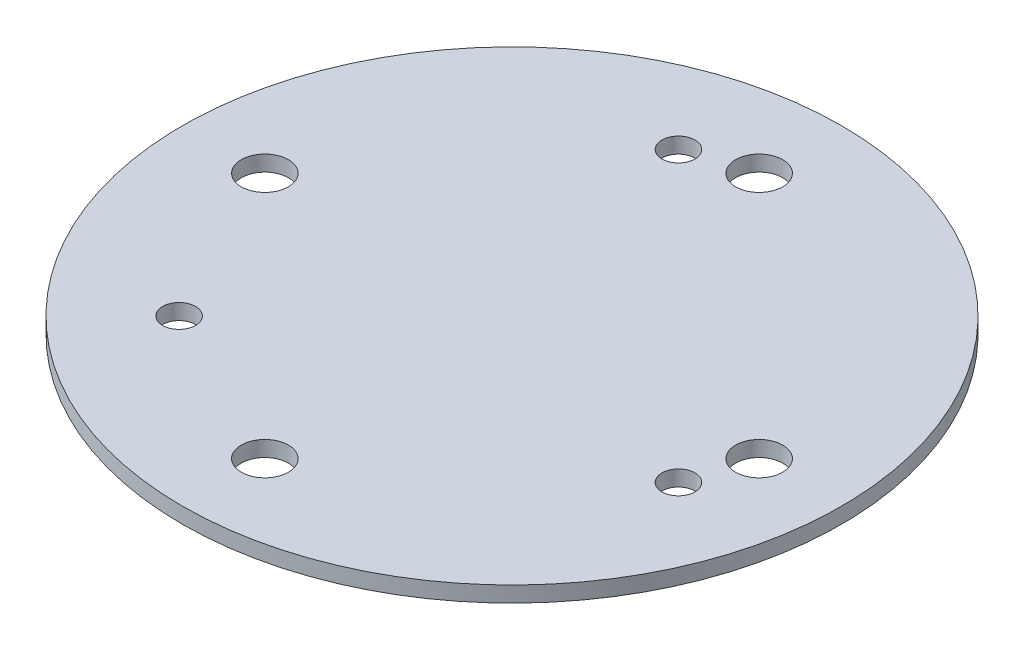
ISO-10303-21;
HEADER;
FILE_DESCRIPTION(('STEP AP214'),'2;1');
FILE_NAME('part.step','',(''),(''),'','','');
FILE_SCHEMA(('AUTOMOTIVE_DESIGN { 1 0 10303 214 1 1 1 1 }'));
ENDSEC;
DATA;
#1=APPLICATION_CONTEXT('core data for automotive mechanical design processes');
#2=APPLICATION_PROTOCOL_DEFINITION('international standard','automotive_design',2000,#1);
#3=PRODUCT_CONTEXT('',#1,'mechanical');
#4=PRODUCT('Part','Part','',(#3));
#5=PRODUCT_RELATED_PRODUCT_CATEGORY('part','',(#4));
#6=PRODUCT_DEFINITION_FORMATION('','',#4);
#7=PRODUCT_DEFINITION_CONTEXT('part definition',#1,'design');
#8=PRODUCT_DEFINITION('design','',#6,#7);
#9=PRODUCT_DEFINITION_SHAPE('','',#8);
#10=(LENGTH_UNIT() NAMED_UNIT(*) SI_UNIT(.MILLI.,.METRE.));
#11=(NAMED_UNIT(*) PLANE_ANGLE_UNIT() SI_UNIT($,.RADIAN.));
#12=(NAMED_UNIT(*) SI_UNIT($,.STERADIAN.) SOLID_ANGLE_UNIT());
#13=UNCERTAINTY_MEASURE_WITH_UNIT(LENGTH_MEASURE(1.E-05),#10,'distance_accuracy_value','');
#14=(GEOMETRIC_REPRESENTATION_CONTEXT(3) GLOBAL_UNCERTAINTY_ASSIGNED_CONTEXT((#13)) GLOBAL_UNIT_ASSIGNED_CONTEXT((#10,
#11,#12)) REPRESENTATION_CONTEXT('',''));
#15=CARTESIAN_POINT('',(0.,0.,0.));
#16=DIRECTION('',(0.,0.,1.));
#17=DIRECTION('',(1.,0.,0.));
#18=AXIS2_PLACEMENT_3D('',#15,#16,#17);
#19=CARTESIAN_POINT('',(0.,0.,0.));
#20=DIRECTION('',(0.,1.,0.));
#21=DIRECTION('',(0.,0.,1.));
#22=AXIS2_PLACEMENT_3D('',#19,#20,#21);
#23=PLANE('',#22);
#24=CARTESIAN_POINT('',(0.,0.,-31.5));
#25=DIRECTION('',(0.,1.,0.));
#26=DIRECTION('',(0.,0.,1.));
#27=AXIS2_PLACEMENT_3D('',#24,#25,#26);
#28=CIRCLE('',#27,3.);
#29=CARTESIAN_POINT('',(0.,0.,-28.5));
#30=VERTEX_POINT('',#29);
#31=EDGE_CURVE('E54',#30,#30,#28,.T.);
#32=ORIENTED_EDGE('',*,*,#31,.T.);
#33=EDGE_LOOP('',(#32));
#34=FACE_BOUND('',#33,.T.);
#35=CARTESIAN_POINT('',(0.,0.,31.5));
#36=DIRECTION('',(0.,1.,0.));
#37=DIRECTION('',(0.,0.,1.));
#38=AXIS2_PLACEMENT_3D('',#35,#36,#37);
#39=CIRCLE('',#38,3.);
#40=CARTESIAN_POINT('',(0.,0.,34.5));
#41=VERTEX_POINT('',#40);
#42=EDGE_CURVE('E45',#41,#41,#39,.T.);
#43=ORIENTED_EDGE('',*,*,#42,.T.);
#44=EDGE_LOOP('',(#43));
#45=FACE_BOUND('',#44,.T.);
#46=CARTESIAN_POINT('',(-21.2132034355964,0.,21.2132034355964));
#47=DIRECTION('',(0.,1.,0.));
#48=DIRECTION('',(0.,0.,1.));
#49=AXIS2_PLACEMENT_3D('',#46,#47,#48);
#50=CIRCLE('',#49,2.1);
#51=CARTESIAN_POINT('',(-21.2132034355964,0.,23.3132034355964));
#52=VERTEX_POINT('',#51);
#53=EDGE_CURVE('E48',#52,#52,#50,.T.);
#54=ORIENTED_EDGE('',*,*,#53,.T.);
#55=EDGE_LOOP('',(#54));
#56=FACE_BOUND('',#55,.T.);
#57=CARTESIAN_POINT('',(-31.5,0.,0.));
#58=DIRECTION('',(0.,1.,0.));
#59=DIRECTION('',(0.,0.,1.));
#60=AXIS2_PLACEMENT_3D('',#57,#58,#59);
#61=CIRCLE('',#60,3.);
#62=CARTESIAN_POINT('',(-31.5,0.,3.));
#63=VERTEX_POINT('',#62);
#64=EDGE_CURVE('E51',#63,#63,#61,.T.);
#65=ORIENTED_EDGE('',*,*,#64,.T.);
#66=EDGE_LOOP('',(#65));
#67=FACE_BOUND('',#66,.T.);
#68=CARTESIAN_POINT('',(31.5,0.,0.));
#69=DIRECTION('',(0.,1.,0.));
#70=DIRECTION('',(0.,0.,1.));
#71=AXIS2_PLACEMENT_3D('',#68,#69,#70);
#72=CIRCLE('',#71,3.);
#73=CARTESIAN_POINT('',(31.5,0.,3.));
#74=VERTEX_POINT('',#73);
#75=EDGE_CURVE('E57',#74,#74,#72,.T.);
#76=ORIENTED_EDGE('',*,*,#75,.T.);
#77=EDGE_LOOP('',(#76));
#78=FACE_BOUND('',#77,.T.);
#79=CARTESIAN_POINT('',(-7.7645713530756,0.,-28.977774788672));
#80=DIRECTION('',(0.,1.,0.));
#81=DIRECTION('',(0.,0.,1.));
#82=AXIS2_PLACEMENT_3D('',#79,#80,#81);
#83=CIRCLE('',#82,2.1);
#84=CARTESIAN_POINT('',(-7.7645713530756,0.,-26.877774788672));
#85=VERTEX_POINT('',#84);
#86=EDGE_CURVE('E62',#85,#85,#83,.T.);
#87=ORIENTED_EDGE('',*,*,#86,.T.);
#88=EDGE_LOOP('',(#87));
#89=FACE_BOUND('',#88,.T.);
#90=CARTESIAN_POINT('',(28.977774788672,0.,7.76457135307563));
#91=DIRECTION('',(0.,1.,0.));
#92=DIRECTION('',(0.,0.,1.));
#93=AXIS2_PLACEMENT_3D('',#90,#91,#92);
#94=CIRCLE('',#93,2.1);
#95=CARTESIAN_POINT('',(28.977774788672,0.,9.86457135307563));
#96=VERTEX_POINT('',#95);
#97=EDGE_CURVE('E60',#96,#96,#94,.T.);
#98=ORIENTED_EDGE('',*,*,#97,.T.);
#99=EDGE_LOOP('',(#98));
#100=FACE_BOUND('',#99,.T.);
#101=CARTESIAN_POINT('',(0.,0.,0.));
#102=DIRECTION('',(0.,1.,0.));
#103=DIRECTION('',(0.,0.,1.));
#104=AXIS2_PLACEMENT_3D('',#101,#102,#103);
#105=CIRCLE('',#104,42.);
#106=CARTESIAN_POINT('',(0.,0.,42.));
#107=VERTEX_POINT('',#106);
#108=EDGE_CURVE('E16',#107,#107,#105,.T.);
#109=ORIENTED_EDGE('',*,*,#108,.F.);
#110=EDGE_LOOP('',(#109));
#111=FACE_BOUND('',#110,.T.);
#112=ADVANCED_FACE('F13',(#34,#45,#56,#67,#78,#89,#100,#111),#23,.F.);
#113=CARTESIAN_POINT('',(0.,0.,0.));
#114=DIRECTION('',(0.,1.,0.));
#115=DIRECTION('',(0.,0.,1.));
#116=AXIS2_PLACEMENT_3D('',#113,#114,#115);
#117=CYLINDRICAL_SURFACE('',#116,42.);
#118=ORIENTED_EDGE('',*,*,#108,.T.);
#119=EDGE_LOOP('',(#118));
#120=FACE_BOUND('',#119,.T.);
#121=CARTESIAN_POINT('',(0.,2.,0.));
#122=DIRECTION('',(0.,1.,0.));
#123=DIRECTION('',(0.,0.,1.));
#124=AXIS2_PLACEMENT_3D('',#121,#122,#123);
#125=CIRCLE('',#124,42.);
#126=CARTESIAN_POINT('',(0.,2.,42.));
#127=VERTEX_POINT('',#126);
#128=EDGE_CURVE('E42',#127,#127,#125,.T.);
#129=ORIENTED_EDGE('',*,*,#128,.F.);
#130=EDGE_LOOP('',(#129));
#131=FACE_BOUND('',#130,.T.);
#132=ADVANCED_FACE('F69',(#120,#131),#117,.T.);
#133=CARTESIAN_POINT('',(-7.7645713530756,0.,-28.977774788672));
#134=DIRECTION('',(0.,1.,0.));
#135=DIRECTION('',(0.,0.,1.));
#136=AXIS2_PLACEMENT_3D('',#133,#134,#135);
#137=CYLINDRICAL_SURFACE('',#136,2.1);
#138=CARTESIAN_POINT('',(-7.7645713530756,2.,-28.977774788672));
#139=DIRECTION('',(0.,1.,0.));
#140=DIRECTION('',(0.,0.,1.));
#141=AXIS2_PLACEMENT_3D('',#138,#139,#140);
#142=CIRCLE('',#141,2.1);
#143=CARTESIAN_POINT('',(-7.7645713530756,2.,-26.877774788672));
#144=VERTEX_POINT('',#143);
#145=EDGE_CURVE('E39',#144,#144,#142,.F.);
#146=ORIENTED_EDGE('',*,*,#145,.F.);
#147=EDGE_LOOP('',(#146));
#148=FACE_BOUND('',#147,.T.);
#149=ORIENTED_EDGE('',*,*,#86,.F.);
#150=EDGE_LOOP('',(#149));
#151=FACE_BOUND('',#150,.T.);
#152=ADVANCED_FACE('F78',(#148,#151),#137,.F.);
#153=CARTESIAN_POINT('',(28.977774788672,0.,7.76457135307563));
#154=DIRECTION('',(0.,1.,0.));
#155=DIRECTION('',(0.,0.,1.));
#156=AXIS2_PLACEMENT_3D('',#153,#154,#155);
#157=CYLINDRICAL_SURFACE('',#156,2.1);
#158=CARTESIAN_POINT('',(28.977774788672,2.,7.76457135307563));
#159=DIRECTION('',(0.,1.,0.));
#160=DIRECTION('',(0.,0.,1.));
#161=AXIS2_PLACEMENT_3D('',#158,#159,#160);
#162=CIRCLE('',#161,2.1);
#163=CARTESIAN_POINT('',(28.977774788672,2.,9.86457135307563));
#164=VERTEX_POINT('',#163);
#165=EDGE_CURVE('E36',#164,#164,#162,.F.);
#166=ORIENTED_EDGE('',*,*,#165,.F.);
#167=EDGE_LOOP('',(#166));
#168=FACE_BOUND('',#167,.T.);
#169=ORIENTED_EDGE('',*,*,#97,.F.);
#170=EDGE_LOOP('',(#169));
#171=FACE_BOUND('',#170,.T.);
#172=ADVANCED_FACE('F106',(#168,#171),#157,.F.);
#173=CARTESIAN_POINT('',(31.5,0.,0.));
#174=DIRECTION('',(0.,1.,0.));
#175=DIRECTION('',(0.,0.,1.));
#176=AXIS2_PLACEMENT_3D('',#173,#174,#175);
#177=CYLINDRICAL_SURFACE('',#176,3.);
#178=CARTESIAN_POINT('',(31.5,2.,0.));
#179=DIRECTION('',(0.,1.,0.));
#180=DIRECTION('',(0.,0.,1.));
#181=AXIS2_PLACEMENT_3D('',#178,#179,#180);
#182=CIRCLE('',#181,3.);
#183=CARTESIAN_POINT('',(31.5,2.,3.));
#184=VERTEX_POINT('',#183);
#185=EDGE_CURVE('E33',#184,#184,#182,.F.);
#186=ORIENTED_EDGE('',*,*,#185,.F.);
#187=EDGE_LOOP('',(#186));
#188=FACE_BOUND('',#187,.T.);
#189=ORIENTED_EDGE('',*,*,#75,.F.);
#190=EDGE_LOOP('',(#189));
#191=FACE_BOUND('',#190,.T.);
#192=ADVANCED_FACE('F102',(#188,#191),#177,.F.);
#193=CARTESIAN_POINT('',(0.,0.,-31.5));
#194=DIRECTION('',(0.,1.,0.));
#195=DIRECTION('',(0.,0.,1.));
#196=AXIS2_PLACEMENT_3D('',#193,#194,#195);
#197=CYLINDRICAL_SURFACE('',#196,3.);
#198=ORIENTED_EDGE('',*,*,#31,.F.);
#199=EDGE_LOOP('',(#198));
#200=FACE_BOUND('',#199,.T.);
#201=CARTESIAN_POINT('',(0.,2.,-31.5));
#202=DIRECTION('',(0.,1.,0.));
#203=DIRECTION('',(0.,0.,1.));
#204=AXIS2_PLACEMENT_3D('',#201,#202,#203);
#205=CIRCLE('',#204,3.);
#206=CARTESIAN_POINT('',(0.,2.,-28.5));
#207=VERTEX_POINT('',#206);
#208=EDGE_CURVE('E30',#207,#207,#205,.F.);
#209=ORIENTED_EDGE('',*,*,#208,.F.);
#210=EDGE_LOOP('',(#209));
#211=FACE_BOUND('',#210,.T.);
#212=ADVANCED_FACE('F98',(#200,#211),#197,.F.);
#213=CARTESIAN_POINT('',(-31.5,0.,0.));
#214=DIRECTION('',(0.,1.,0.));
#215=DIRECTION('',(0.,0.,1.));
#216=AXIS2_PLACEMENT_3D('',#213,#214,#215);
#217=CYLINDRICAL_SURFACE('',#216,3.);
#218=ORIENTED_EDGE('',*,*,#64,.F.);
#219=EDGE_LOOP('',(#218));
#220=FACE_BOUND('',#219,.T.);
#221=CARTESIAN_POINT('',(-31.5,2.,0.));
#222=DIRECTION('',(0.,1.,0.));
#223=DIRECTION('',(0.,0.,1.));
#224=AXIS2_PLACEMENT_3D('',#221,#222,#223);
#225=CIRCLE('',#224,3.);
#226=CARTESIAN_POINT('',(-31.5,2.,3.));
#227=VERTEX_POINT('',#226);
#228=EDGE_CURVE('E25',#227,#227,#225,.F.);
#229=ORIENTED_EDGE('',*,*,#228,.F.);
#230=EDGE_LOOP('',(#229));
#231=FACE_BOUND('',#230,.T.);
#232=ADVANCED_FACE('F94',(#220,#231),#217,.F.);
#233=CARTESIAN_POINT('',(-21.2132034355964,0.,21.2132034355964));
#234=DIRECTION('',(0.,1.,0.));
#235=DIRECTION('',(0.,0.,1.));
#236=AXIS2_PLACEMENT_3D('',#233,#234,#235);
#237=CYLINDRICAL_SURFACE('',#236,2.1);
#238=ORIENTED_EDGE('',*,*,#53,.F.);
#239=EDGE_LOOP('',(#238));
#240=FACE_BOUND('',#239,.T.);
#241=CARTESIAN_POINT('',(-21.2132034355964,2.,21.2132034355964));
#242=DIRECTION('',(0.,1.,0.));
#243=DIRECTION('',(0.,0.,1.));
#244=AXIS2_PLACEMENT_3D('',#241,#242,#243);
#245=CIRCLE('',#244,2.1);
#246=CARTESIAN_POINT('',(-21.2132034355964,2.,23.3132034355964));
#247=VERTEX_POINT('',#246);
#248=EDGE_CURVE('E20',#247,#247,#245,.F.);
#249=ORIENTED_EDGE('',*,*,#248,.F.);
#250=EDGE_LOOP('',(#249));
#251=FACE_BOUND('',#250,.T.);
#252=ADVANCED_FACE('F87',(#240,#251),#237,.F.);
#253=CARTESIAN_POINT('',(0.,0.,31.5));
#254=DIRECTION('',(0.,1.,0.));
#255=DIRECTION('',(0.,0.,1.));
#256=AXIS2_PLACEMENT_3D('',#253,#254,#255);
#257=CYLINDRICAL_SURFACE('',#256,3.);
#258=ORIENTED_EDGE('',*,*,#42,.F.);
#259=EDGE_LOOP('',(#258));
#260=FACE_BOUND('',#259,.T.);
#261=CARTESIAN_POINT('',(0.,2.,31.5));
#262=DIRECTION('',(0.,1.,0.));
#263=DIRECTION('',(0.,0.,1.));
#264=AXIS2_PLACEMENT_3D('',#261,#262,#263);
#265=CIRCLE('',#264,3.);
#266=CARTESIAN_POINT('',(0.,2.,34.5));
#267=VERTEX_POINT('',#266);
#268=EDGE_CURVE('E9',#267,#267,#265,.F.);
#269=ORIENTED_EDGE('',*,*,#268,.F.);
#270=EDGE_LOOP('',(#269));
#271=FACE_BOUND('',#270,.T.);
#272=ADVANCED_FACE('F82',(#260,#271),#257,.F.);
#273=CARTESIAN_POINT('',(0.,2.,0.));
#274=DIRECTION('',(0.,1.,0.));
#275=DIRECTION('',(0.,0.,1.));
#276=AXIS2_PLACEMENT_3D('',#273,#274,#275);
#277=PLANE('',#276);
#278=ORIENTED_EDGE('',*,*,#268,.T.);
#279=EDGE_LOOP('',(#278));
#280=FACE_BOUND('',#279,.T.);
#281=ORIENTED_EDGE('',*,*,#248,.T.);
#282=EDGE_LOOP('',(#281));
#283=FACE_BOUND('',#282,.T.);
#284=ORIENTED_EDGE('',*,*,#228,.T.);
#285=EDGE_LOOP('',(#284));
#286=FACE_BOUND('',#285,.T.);
#287=ORIENTED_EDGE('',*,*,#208,.T.);
#288=EDGE_LOOP('',(#287));
#289=FACE_BOUND('',#288,.T.);
#290=ORIENTED_EDGE('',*,*,#185,.T.);
#291=EDGE_LOOP('',(#290));
#292=FACE_BOUND('',#291,.T.);
#293=ORIENTED_EDGE('',*,*,#165,.T.);
#294=EDGE_LOOP('',(#293));
#295=FACE_BOUND('',#294,.T.);
#296=ORIENTED_EDGE('',*,*,#145,.T.);
#297=EDGE_LOOP('',(#296));
#298=FACE_BOUND('',#297,.T.);
#299=ORIENTED_EDGE('',*,*,#128,.T.);
#300=EDGE_LOOP('',(#299));
#301=FACE_BOUND('',#300,.T.);
#302=ADVANCED_FACE('F80',(#280,#283,#286,#289,#292,#295,#298,#301),#277,.T.);
#303=CLOSED_SHELL('',(#112,#132,#152,#172,#192,#212,#232,#252,#272,#302));
#304=MANIFOLD_SOLID_BREP('B1',#303);
#305=ADVANCED_BREP_SHAPE_REPRESENTATION('',(#18,#304),#14);
#306=SHAPE_DEFINITION_REPRESENTATION(#9,#305);
ENDSEC;
END-ISO-10303-21;
